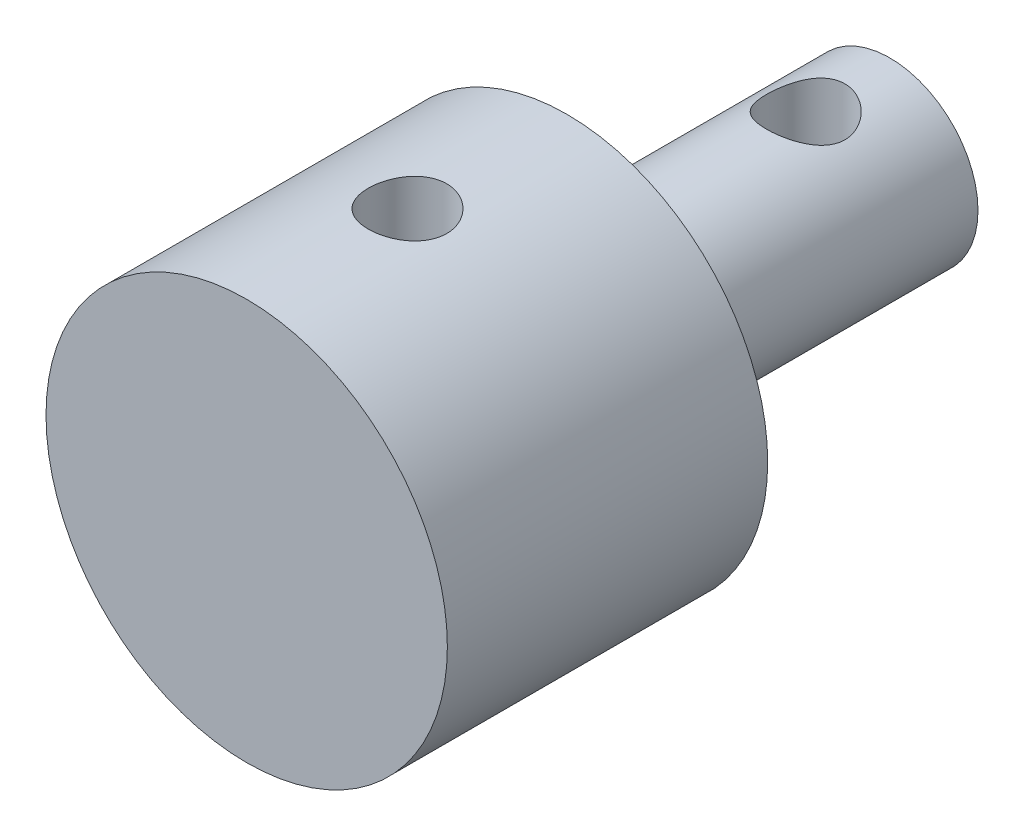
ISO-10303-21;
HEADER;
FILE_DESCRIPTION(('STEP AP214'),'2;1');
FILE_NAME('part.step','',(''),(''),'','','');
FILE_SCHEMA(('AUTOMOTIVE_DESIGN { 1 0 10303 214 1 1 1 1 }'));
ENDSEC;
DATA;
#1=APPLICATION_CONTEXT('core data for automotive mechanical design processes');
#2=APPLICATION_PROTOCOL_DEFINITION('international standard','automotive_design',2000,#1);
#3=PRODUCT_CONTEXT('',#1,'mechanical');
#4=PRODUCT('Part','Part','',(#3));
#5=PRODUCT_RELATED_PRODUCT_CATEGORY('part','',(#4));
#6=PRODUCT_DEFINITION_FORMATION('','',#4);
#7=PRODUCT_DEFINITION_CONTEXT('part definition',#1,'design');
#8=PRODUCT_DEFINITION('design','',#6,#7);
#9=PRODUCT_DEFINITION_SHAPE('','',#8);
#10=(LENGTH_UNIT() NAMED_UNIT(*) SI_UNIT(.MILLI.,.METRE.));
#11=(NAMED_UNIT(*) PLANE_ANGLE_UNIT() SI_UNIT($,.RADIAN.));
#12=(NAMED_UNIT(*) SI_UNIT($,.STERADIAN.) SOLID_ANGLE_UNIT());
#13=UNCERTAINTY_MEASURE_WITH_UNIT(LENGTH_MEASURE(1.E-05),#10,'distance_accuracy_value','');
#14=(GEOMETRIC_REPRESENTATION_CONTEXT(3) GLOBAL_UNCERTAINTY_ASSIGNED_CONTEXT((#13)) GLOBAL_UNIT_ASSIGNED_CONTEXT((#10,
#11,#12)) REPRESENTATION_CONTEXT('',''));
#15=CARTESIAN_POINT('',(0.,0.,0.));
#16=DIRECTION('',(0.,0.,1.));
#17=DIRECTION('',(1.,0.,0.));
#18=AXIS2_PLACEMENT_3D('',#15,#16,#17);
#19=CARTESIAN_POINT('',(0.,0.,25.4));
#20=DIRECTION('',(0.,0.,-1.));
#21=DIRECTION('',(-1.,0.,0.));
#22=AXIS2_PLACEMENT_3D('',#19,#20,#21);
#23=CYLINDRICAL_SURFACE('',#22,7.925);
#24=CARTESIAN_POINT('',(0.,-7.925,20.6));
#25=CARTESIAN_POINT('',(0.0861838108453866,-7.92499841926355,20.5999967837673));
#26=CARTESIAN_POINT('',(0.17240870233735,-7.92357967552833,20.5927876642372));
#27=CARTESIAN_POINT('',(0.342423948086106,-7.91805683622166,20.56416299903));
#28=CARTESIAN_POINT('',(0.426212267025402,-7.91395055939029,20.5427359135489));
#29=CARTESIAN_POINT('',(0.588871412790293,-7.90351147229811,20.4863603860152));
#30=CARTESIAN_POINT('',(0.667746772772678,-7.89718075144916,20.4514246295233));
#31=CARTESIAN_POINT('',(0.818510394217395,-7.88298210045821,20.3690605539179));
#32=CARTESIAN_POINT('',(0.890399124917666,-7.87511427365873,20.3216330745718));
#33=CARTESIAN_POINT('',(1.02608800119762,-7.85859405840611,20.2149789338671));
#34=CARTESIAN_POINT('',(1.08978438212797,-7.84993361146879,20.155621494742));
#35=CARTESIAN_POINT('',(1.20638226030049,-7.83286329328287,20.0270735742275));
#36=CARTESIAN_POINT('',(1.25928293936707,-7.82445344106734,19.957882348237));
#37=CARTESIAN_POINT('',(1.35322579664995,-7.80875795055944,19.8108892501759));
#38=CARTESIAN_POINT('',(1.39416121115848,-7.80148268877842,19.733017939903));
#39=CARTESIAN_POINT('',(1.46232775062974,-7.78899423853807,19.5713369959598));
#40=CARTESIAN_POINT('',(1.48956016704955,-7.78378085576415,19.4875279227514));
#41=CARTESIAN_POINT('',(1.52921220075574,-7.77608782468047,19.3174647091172));
#42=CARTESIAN_POINT('',(1.54181348339279,-7.77357467919549,19.2312544717756));
#43=CARTESIAN_POINT('',(1.55240967453143,-7.77146578630902,19.0579096084589));
#44=CARTESIAN_POINT('',(1.55040601008254,-7.77186975387635,18.9707750736277));
#45=CARTESIAN_POINT('',(1.53199621639429,-7.775518986543,18.7993794610282));
#46=CARTESIAN_POINT('',(1.51579773382123,-7.77872328560814,18.7150950778425));
#47=CARTESIAN_POINT('',(1.46978561127739,-7.7875476905229,18.5504637381507));
#48=CARTESIAN_POINT('',(1.43997134680109,-7.79316790718102,18.4701169624354));
#49=CARTESIAN_POINT('',(1.36737398097193,-7.80623311261551,18.3150398811511));
#50=CARTESIAN_POINT('',(1.32450802186827,-7.81368969988944,18.2403493819913));
#51=CARTESIAN_POINT('',(1.2270825854135,-7.82957995115312,18.099143482776));
#52=CARTESIAN_POINT('',(1.17252182062576,-7.83801372267035,18.0326289840547));
#53=CARTESIAN_POINT('',(1.0521409836078,-7.85508591343413,17.9084644535961));
#54=CARTESIAN_POINT('',(0.986143548277975,-7.86372535899091,17.8509863832633));
#55=CARTESIAN_POINT('',(0.845353664724789,-7.88010257327559,17.7478902773619));
#56=CARTESIAN_POINT('',(0.77056111296,-7.88784033138615,17.7022723814388));
#57=CARTESIAN_POINT('',(0.61411726395948,-7.90156009368255,17.6241620785197));
#58=CARTESIAN_POINT('',(0.532456233632123,-7.9075395504362,17.5916886899455));
#59=CARTESIAN_POINT('',(0.364695002697914,-7.91704953308192,17.5409691222318));
#60=CARTESIAN_POINT('',(0.278595317165379,-7.92058034243791,17.5227212962613));
#61=CARTESIAN_POINT('',(0.1058791754735,-7.92475592153562,17.5012128200005));
#62=CARTESIAN_POINT('',(0.0192930994156984,-7.92544602352876,17.4977167372747));
#63=CARTESIAN_POINT('',(-0.153226133355567,-7.92398809704793,17.5051778491985));
#64=CARTESIAN_POINT('',(-0.239159324850617,-7.9218402208451,17.516134268402));
#65=CARTESIAN_POINT('',(-0.407178536745109,-7.91497599311411,17.5519937207594));
#66=CARTESIAN_POINT('',(-0.489291194451464,-7.91028178748217,17.5767765552519));
#67=CARTESIAN_POINT('',(-0.648195694215873,-7.89884923165551,17.6394544563723));
#68=CARTESIAN_POINT('',(-0.724987150309032,-7.89211073337152,17.6773504729516));
#69=CARTESIAN_POINT('',(-0.872066606050378,-7.87722407193125,17.7656925623776));
#70=CARTESIAN_POINT('',(-0.942267392417723,-7.86906024608956,17.8162811408567));
#71=CARTESIAN_POINT('',(-1.07326791977358,-7.85226658751978,17.9283807930467));
#72=CARTESIAN_POINT('',(-1.13406669873031,-7.84363670722582,17.9898929831013));
#73=CARTESIAN_POINT('',(-1.24544096012996,-7.82673164163632,18.1231634257448));
#74=CARTESIAN_POINT('',(-1.29585515535405,-7.8184634273025,18.1950575013779));
#75=CARTESIAN_POINT('',(-1.38389200017043,-7.80336281640772,18.346431933197));
#76=CARTESIAN_POINT('',(-1.42151514932589,-7.79653036377608,18.4259119929519));
#77=CARTESIAN_POINT('',(-1.48267865261352,-7.78513059768089,18.5898101035222));
#78=CARTESIAN_POINT('',(-1.506290279852,-7.78055184089878,18.6742007230067));
#79=CARTESIAN_POINT('',(-1.53897802198646,-7.77415294549628,18.8458501668698));
#80=CARTESIAN_POINT('',(-1.54805593941779,-7.77233246478372,18.933108634195));
#81=CARTESIAN_POINT('',(-1.55135415156336,-7.77167464832441,19.1063988676115));
#82=CARTESIAN_POINT('',(-1.545829140864,-7.77278617379779,19.1924256938153));
#83=CARTESIAN_POINT('',(-1.52063882684956,-7.77775318086787,19.3622986215592));
#84=CARTESIAN_POINT('',(-1.5009736262888,-7.78160864252486,19.4461447389414));
#85=CARTESIAN_POINT('',(-1.4481725782255,-7.79160671898283,19.609123126546));
#86=CARTESIAN_POINT('',(-1.41506665015915,-7.79774425129309,19.6882654219184));
#87=CARTESIAN_POINT('',(-1.33635262416708,-7.81161806702618,19.839912430142));
#88=CARTESIAN_POINT('',(-1.29074353674063,-7.81935447697234,19.9124166170468));
#89=CARTESIAN_POINT('',(-1.18744235013671,-7.83571164154751,20.0500002623682));
#90=CARTESIAN_POINT('',(-1.12956579816527,-7.84434473268747,20.1149397871895));
#91=CARTESIAN_POINT('',(-1.00375480711516,-7.86143264989829,20.2342696728911));
#92=CARTESIAN_POINT('',(-0.935818060707144,-7.8698874345646,20.288657607111));
#93=CARTESIAN_POINT('',(-0.791005261002712,-7.88576493622371,20.3858485553922));
#94=CARTESIAN_POINT('',(-0.714047137150093,-7.8931765707638,20.4285311647171));
#95=CARTESIAN_POINT('',(-0.553928891907305,-7.90602394186755,20.5002913483058));
#96=CARTESIAN_POINT('',(-0.47077452700537,-7.91146148550279,20.5293813721837));
#97=CARTESIAN_POINT('',(-0.322843472408581,-7.91867276855423,20.5673981409176));
#98=CARTESIAN_POINT('',(-0.258917328106175,-7.92103177083739,20.5796023690083));
#99=CARTESIAN_POINT('',(-0.13000189383201,-7.92419595989978,20.5959043922953));
#100=CARTESIAN_POINT('',(-0.0650126352180937,-7.92500119242629,20.6000024261606));
#101=CARTESIAN_POINT('',(0.,-7.925,20.6));
#102=B_SPLINE_CURVE_WITH_KNOTS('',3,(#24,#25,#26,#27,#28,#29,#30,#31,#32,#33,#34,#35,#36,#37,
#38,#39,#40,#41,#42,#43,#44,#45,#46,#47,#48,#49,#50,#51,#52,#53,#54,#55,#56,#57,#58,#59,#60,#61,
#62,#63,#64,#65,#66,#67,#68,#69,#70,#71,#72,#73,#74,#75,#76,#77,#78,#79,#80,#81,#82,#83,#84,#85,
#86,#87,#88,#89,#90,#91,#92,#93,#94,#95,#96,#97,#98,#99,#100,#101),.UNSPECIFIED.,.T.,.F.,(4,2,2,
2,2,2,2,2,2,2,2,2,2,2,2,2,2,2,2,2,2,2,2,2,2,2,2,2,2,2,2,2,2,2,2,2,2,2,4),(0.,0.258313626033328,
0.516837165407023,0.77511852088897,1.03338251760152,1.29464935612841,1.55593598797964,
1.81948744358056,2.08301405577373,2.34323240377065,2.6034253261709,2.85987442698651,
3.11633529135459,3.37445948154057,3.6326121022432,3.8952006635526,4.15779231652299,
4.42076255952126,4.68370235508651,4.94242947154845,5.20114270662314,5.45764112156988,
5.71415812178877,5.97369523618958,6.2332588893888,6.49659198537846,6.75991479552951,
7.02188640414186,7.28382551935222,7.54122634017236,7.79862529052409,8.05545437803332,
8.31230379688142,8.57333059290651,8.83441734903393,9.09809677008675,9.36153420825261,
9.55639846233918,9.75125697899604),.UNSPECIFIED.);
#103=CARTESIAN_POINT('',(0.,-7.925,20.6));
#104=VERTEX_POINT('',#103);
#105=EDGE_CURVE('E11',#104,#104,#102,.T.);
#106=ORIENTED_EDGE('',*,*,#105,.T.);
#107=EDGE_LOOP('',(#106));
#108=FACE_BOUND('',#107,.T.);
#109=CARTESIAN_POINT('',(0.,7.925,20.6));
#110=CARTESIAN_POINT('',(-0.0861838108453866,7.92499841926355,20.5999967837673));
#111=CARTESIAN_POINT('',(-0.17240870233735,7.92357967552833,20.5927876642372));
#112=CARTESIAN_POINT('',(-0.342423948086106,7.91805683622166,20.56416299903));
#113=CARTESIAN_POINT('',(-0.426212267025402,7.91395055939029,20.5427359135489));
#114=CARTESIAN_POINT('',(-0.588871412790293,7.90351147229811,20.4863603860152));
#115=CARTESIAN_POINT('',(-0.667746772772678,7.89718075144916,20.4514246295233));
#116=CARTESIAN_POINT('',(-0.818510394217395,7.88298210045821,20.3690605539179));
#117=CARTESIAN_POINT('',(-0.890399124917666,7.87511427365873,20.3216330745718));
#118=CARTESIAN_POINT('',(-1.02608800119762,7.85859405840611,20.2149789338671));
#119=CARTESIAN_POINT('',(-1.08978438212797,7.84993361146879,20.155621494742));
#120=CARTESIAN_POINT('',(-1.20638226030049,7.83286329328287,20.0270735742275));
#121=CARTESIAN_POINT('',(-1.25928293936707,7.82445344106734,19.957882348237));
#122=CARTESIAN_POINT('',(-1.35322579664995,7.80875795055944,19.8108892501759));
#123=CARTESIAN_POINT('',(-1.39416121115848,7.80148268877842,19.733017939903));
#124=CARTESIAN_POINT('',(-1.46232775062974,7.78899423853807,19.5713369959598));
#125=CARTESIAN_POINT('',(-1.48956016704955,7.78378085576415,19.4875279227514));
#126=CARTESIAN_POINT('',(-1.52921220075574,7.77608782468047,19.3174647091172));
#127=CARTESIAN_POINT('',(-1.54181348339279,7.77357467919549,19.2312544717756));
#128=CARTESIAN_POINT('',(-1.55240967453143,7.77146578630902,19.0579096084589));
#129=CARTESIAN_POINT('',(-1.55040601008254,7.77186975387635,18.9707750736277));
#130=CARTESIAN_POINT('',(-1.53199621639429,7.775518986543,18.7993794610282));
#131=CARTESIAN_POINT('',(-1.51579773382123,7.77872328560814,18.7150950778425));
#132=CARTESIAN_POINT('',(-1.46978561127739,7.7875476905229,18.5504637381507));
#133=CARTESIAN_POINT('',(-1.43997134680109,7.79316790718102,18.4701169624354));
#134=CARTESIAN_POINT('',(-1.36737398097193,7.80623311261551,18.3150398811511));
#135=CARTESIAN_POINT('',(-1.32450802186827,7.81368969988944,18.2403493819913));
#136=CARTESIAN_POINT('',(-1.2270825854135,7.82957995115312,18.099143482776));
#137=CARTESIAN_POINT('',(-1.17252182062576,7.83801372267035,18.0326289840547));
#138=CARTESIAN_POINT('',(-1.0521409836078,7.85508591343413,17.9084644535961));
#139=CARTESIAN_POINT('',(-0.986143548277975,7.86372535899091,17.8509863832633));
#140=CARTESIAN_POINT('',(-0.845353664724789,7.88010257327559,17.7478902773619));
#141=CARTESIAN_POINT('',(-0.77056111296,7.88784033138615,17.7022723814388));
#142=CARTESIAN_POINT('',(-0.61411726395948,7.90156009368255,17.6241620785197));
#143=CARTESIAN_POINT('',(-0.532456233632123,7.9075395504362,17.5916886899455));
#144=CARTESIAN_POINT('',(-0.364695002697914,7.91704953308192,17.5409691222318));
#145=CARTESIAN_POINT('',(-0.278595317165379,7.92058034243791,17.5227212962613));
#146=CARTESIAN_POINT('',(-0.1058791754735,7.92475592153562,17.5012128200005));
#147=CARTESIAN_POINT('',(-0.0192930994156984,7.92544602352876,17.4977167372747));
#148=CARTESIAN_POINT('',(0.153226133355567,7.92398809704793,17.5051778491985));
#149=CARTESIAN_POINT('',(0.239159324850617,7.9218402208451,17.516134268402));
#150=CARTESIAN_POINT('',(0.407178536745109,7.91497599311411,17.5519937207594));
#151=CARTESIAN_POINT('',(0.489291194451464,7.91028178748217,17.5767765552519));
#152=CARTESIAN_POINT('',(0.648195694215873,7.89884923165551,17.6394544563723));
#153=CARTESIAN_POINT('',(0.724987150309032,7.89211073337152,17.6773504729516));
#154=CARTESIAN_POINT('',(0.872066606050378,7.87722407193125,17.7656925623776));
#155=CARTESIAN_POINT('',(0.942267392417723,7.86906024608956,17.8162811408567));
#156=CARTESIAN_POINT('',(1.07326791977358,7.85226658751978,17.9283807930467));
#157=CARTESIAN_POINT('',(1.13406669873031,7.84363670722582,17.9898929831013));
#158=CARTESIAN_POINT('',(1.24544096012996,7.82673164163632,18.1231634257448));
#159=CARTESIAN_POINT('',(1.29585515535405,7.8184634273025,18.1950575013779));
#160=CARTESIAN_POINT('',(1.38389200017043,7.80336281640772,18.346431933197));
#161=CARTESIAN_POINT('',(1.42151514932589,7.79653036377608,18.4259119929519));
#162=CARTESIAN_POINT('',(1.48267865261352,7.78513059768089,18.5898101035222));
#163=CARTESIAN_POINT('',(1.506290279852,7.78055184089878,18.6742007230067));
#164=CARTESIAN_POINT('',(1.53897802198646,7.77415294549628,18.8458501668698));
#165=CARTESIAN_POINT('',(1.54805593941779,7.77233246478372,18.933108634195));
#166=CARTESIAN_POINT('',(1.55135415156336,7.77167464832441,19.1063988676115));
#167=CARTESIAN_POINT('',(1.545829140864,7.77278617379779,19.1924256938153));
#168=CARTESIAN_POINT('',(1.52063882684956,7.77775318086787,19.3622986215592));
#169=CARTESIAN_POINT('',(1.5009736262888,7.78160864252486,19.4461447389414));
#170=CARTESIAN_POINT('',(1.4481725782255,7.79160671898283,19.609123126546));
#171=CARTESIAN_POINT('',(1.41506665015915,7.79774425129309,19.6882654219184));
#172=CARTESIAN_POINT('',(1.33635262416708,7.81161806702618,19.839912430142));
#173=CARTESIAN_POINT('',(1.29074353674063,7.81935447697234,19.9124166170468));
#174=CARTESIAN_POINT('',(1.18744235013671,7.83571164154751,20.0500002623682));
#175=CARTESIAN_POINT('',(1.12956579816527,7.84434473268747,20.1149397871895));
#176=CARTESIAN_POINT('',(1.00375480711516,7.86143264989829,20.2342696728911));
#177=CARTESIAN_POINT('',(0.935818060707144,7.8698874345646,20.288657607111));
#178=CARTESIAN_POINT('',(0.791005261002712,7.88576493622371,20.3858485553922));
#179=CARTESIAN_POINT('',(0.714047137150093,7.8931765707638,20.4285311647171));
#180=CARTESIAN_POINT('',(0.553928891907305,7.90602394186755,20.5002913483058));
#181=CARTESIAN_POINT('',(0.47077452700537,7.91146148550279,20.5293813721837));
#182=CARTESIAN_POINT('',(0.322843472408581,7.91867276855423,20.5673981409176));
#183=CARTESIAN_POINT('',(0.258917328106175,7.92103177083739,20.5796023690083));
#184=CARTESIAN_POINT('',(0.13000189383201,7.92419595989978,20.5959043922953));
#185=CARTESIAN_POINT('',(0.0650126352180937,7.92500119242629,20.6000024261606));
#186=CARTESIAN_POINT('',(0.,7.925,20.6));
#187=B_SPLINE_CURVE_WITH_KNOTS('',3,(#109,#110,#111,#112,#113,#114,#115,#116,#117,#118,#119,
#120,#121,#122,#123,#124,#125,#126,#127,#128,#129,#130,#131,#132,#133,#134,#135,#136,#137,#138,
#139,#140,#141,#142,#143,#144,#145,#146,#147,#148,#149,#150,#151,#152,#153,#154,#155,#156,#157,
#158,#159,#160,#161,#162,#163,#164,#165,#166,#167,#168,#169,#170,#171,#172,#173,#174,#175,#176,
#177,#178,#179,#180,#181,#182,#183,#184,#185,#186),.UNSPECIFIED.,.T.,.F.,(4,2,2,2,2,2,2,2,2,2,2,
2,2,2,2,2,2,2,2,2,2,2,2,2,2,2,2,2,2,2,2,2,2,2,2,2,2,2,4),(0.,0.258313626033328,
0.516837165407023,0.77511852088897,1.03338251760152,1.29464935612841,1.55593598797964,
1.81948744358056,2.08301405577373,2.34323240377065,2.6034253261709,2.85987442698651,
3.11633529135459,3.37445948154057,3.6326121022432,3.8952006635526,4.15779231652299,
4.42076255952126,4.68370235508651,4.94242947154845,5.20114270662314,5.45764112156988,
5.71415812178877,5.97369523618958,6.2332588893888,6.49659198537846,6.75991479552951,
7.02188640414186,7.28382551935222,7.54122634017236,7.79862529052409,8.05545437803332,
8.31230379688142,8.57333059290651,8.83441734903393,9.09809677008675,9.36153420825261,
9.55639846233918,9.75125697899604),.UNSPECIFIED.);
#188=CARTESIAN_POINT('',(0.,7.925,20.6));
#189=VERTEX_POINT('',#188);
#190=EDGE_CURVE('E71',#189,#189,#187,.T.);
#191=ORIENTED_EDGE('',*,*,#190,.T.);
#192=EDGE_LOOP('',(#191));
#193=FACE_BOUND('',#192,.T.);
#194=CARTESIAN_POINT('',(0.,0.,12.75));
#195=DIRECTION('',(0.,0.,1.));
#196=DIRECTION('',(1.,0.,0.));
#197=AXIS2_PLACEMENT_3D('',#194,#195,#196);
#198=CIRCLE('',#197,7.925);
#199=CARTESIAN_POINT('',(7.925,0.,12.75));
#200=VERTEX_POINT('',#199);
#201=EDGE_CURVE('E79',#200,#200,#198,.T.);
#202=ORIENTED_EDGE('',*,*,#201,.T.);
#203=EDGE_LOOP('',(#202));
#204=FACE_BOUND('',#203,.T.);
#205=CARTESIAN_POINT('',(0.,0.,25.4));
#206=DIRECTION('',(0.,0.,1.));
#207=DIRECTION('',(1.,0.,0.));
#208=AXIS2_PLACEMENT_3D('',#205,#206,#207);
#209=CIRCLE('',#208,7.925);
#210=CARTESIAN_POINT('',(7.925,0.,25.4));
#211=VERTEX_POINT('',#210);
#212=EDGE_CURVE('E75',#211,#211,#209,.T.);
#213=ORIENTED_EDGE('',*,*,#212,.F.);
#214=EDGE_LOOP('',(#213));
#215=FACE_BOUND('',#214,.T.);
#216=ADVANCED_FACE('F61',(#108,#193,#204,#215),#23,.T.);
#217=CARTESIAN_POINT('',(0.,0.,25.4));
#218=DIRECTION('',(0.,0.,1.));
#219=DIRECTION('',(1.,0.,0.));
#220=AXIS2_PLACEMENT_3D('',#217,#218,#219);
#221=PLANE('',#220);
#222=ORIENTED_EDGE('',*,*,#212,.T.);
#223=EDGE_LOOP('',(#222));
#224=FACE_BOUND('',#223,.T.);
#225=ADVANCED_FACE('F131',(#224),#221,.T.);
#226=CARTESIAN_POINT('',(0.,0.,12.75));
#227=DIRECTION('',(0.,0.,1.));
#228=DIRECTION('',(1.,0.,0.));
#229=AXIS2_PLACEMENT_3D('',#226,#227,#228);
#230=PLANE('',#229);
#231=CARTESIAN_POINT('',(0.,0.,12.75));
#232=DIRECTION('',(0.,0.,1.));
#233=DIRECTION('',(1.,0.,0.));
#234=AXIS2_PLACEMENT_3D('',#231,#232,#233);
#235=CIRCLE('',#234,3.48);
#236=CARTESIAN_POINT('',(3.48,0.,12.75));
#237=VERTEX_POINT('',#236);
#238=EDGE_CURVE('E110',#237,#237,#235,.T.);
#239=ORIENTED_EDGE('',*,*,#238,.T.);
#240=EDGE_LOOP('',(#239));
#241=FACE_BOUND('',#240,.T.);
#242=ORIENTED_EDGE('',*,*,#201,.F.);
#243=EDGE_LOOP('',(#242));
#244=FACE_BOUND('',#243,.T.);
#245=ADVANCED_FACE('F124',(#241,#244),#230,.F.);
#246=CARTESIAN_POINT('',(0.,0.,12.75));
#247=DIRECTION('',(0.,0.,-1.));
#248=DIRECTION('',(-1.,0.,0.));
#249=AXIS2_PLACEMENT_3D('',#246,#247,#248);
#250=CYLINDRICAL_SURFACE('',#249,3.48);
#251=CARTESIAN_POINT('',(0.,-3.48,4.875));
#252=CARTESIAN_POINT('',(0.0825138042025776,-3.47999681166933,4.87499610911732));
#253=CARTESIAN_POINT('',(0.165156099422567,-3.47703251674291,4.86837230389632));
#254=CARTESIAN_POINT('',(0.328062088482595,-3.46546962291386,4.84214006073431));
#255=CARTESIAN_POINT('',(0.408319602955723,-3.45685752948132,4.82250052254695));
#256=CARTESIAN_POINT('',(0.563841877376707,-3.4349130798989,4.77112006367128));
#257=CARTESIAN_POINT('',(0.639123364704403,-3.42159760494223,4.7394223906597));
#258=CARTESIAN_POINT('',(0.78321678617367,-3.39151831157571,4.66501920292595));
#259=CARTESIAN_POINT('',(0.852030173435168,-3.37475527040513,4.62231616876779));
#260=CARTESIAN_POINT('',(0.985187182241665,-3.33838440203311,4.52461178753005));
#261=CARTESIAN_POINT('',(1.04912428848442,-3.31867513356709,4.46909459197347));
#262=CARTESIAN_POINT('',(1.16713893116451,-3.27903487448125,4.34843334274395));
#263=CARTESIAN_POINT('',(1.22121056511317,-3.25910375864677,4.28328356784173));
#264=CARTESIAN_POINT('',(1.32107746140071,-3.21996879648826,4.14063730446805));
#265=CARTESIAN_POINT('',(1.36621009388527,-3.20087432701701,4.06264363911592));
#266=CARTESIAN_POINT('',(1.44253512626648,-3.16721410459599,3.89920631486317));
#267=CARTESIAN_POINT('',(1.47373569733,-3.15264569863538,3.81376705804748));
#268=CARTESIAN_POINT('',(1.51957343560433,-3.13080092448009,3.6425355259664));
#269=CARTESIAN_POINT('',(1.53499762232161,-3.12318038784488,3.55699969542774));
#270=CARTESIAN_POINT('',(1.55129121683332,-3.11512236121552,3.38424112670931));
#271=CARTESIAN_POINT('',(1.5521704098892,-3.11468004202168,3.29701956217336));
#272=CARTESIAN_POINT('',(1.53993585497871,-3.12074149270909,3.13176157445786));
#273=CARTESIAN_POINT('',(1.52807398392069,-3.12662387917202,3.05360481079073));
#274=CARTESIAN_POINT('',(1.49281647558756,-3.14360903889719,2.90053540964712));
#275=CARTESIAN_POINT('',(1.4694182316481,-3.15471299195563,2.82562350951687));
#276=CARTESIAN_POINT('',(1.41128859223433,-3.18114751632626,2.67915535912476));
#277=CARTESIAN_POINT('',(1.37631425614932,-3.19656748906207,2.60771239780291));
#278=CARTESIAN_POINT('',(1.29620009871018,-3.22988308808876,2.4714066303134));
#279=CARTESIAN_POINT('',(1.25105598925041,-3.2477797574525,2.4065466166417));
#280=CARTESIAN_POINT('',(1.14670786053793,-3.28615889477307,2.27856471324293));
#281=CARTESIAN_POINT('',(1.08656015679323,-3.30672300115649,2.21623435150887));
#282=CARTESIAN_POINT('',(0.956494403407271,-3.34666170618366,2.10225796782148));
#283=CARTESIAN_POINT('',(0.886573385682492,-3.3660359408897,2.0506152034758));
#284=CARTESIAN_POINT('',(0.736246383006499,-3.40212929046977,1.95808542789697));
#285=CARTESIAN_POINT('',(0.655590138080516,-3.41875213759735,1.91756458137013));
#286=CARTESIAN_POINT('',(0.487675125128289,-3.44670812113681,1.85095237096535));
#287=CARTESIAN_POINT('',(0.400420577556669,-3.45804460614251,1.82485187071969));
#288=CARTESIAN_POINT('',(0.228361096839682,-3.47349724876202,1.7895799630011));
#289=CARTESIAN_POINT('',(0.143813950176328,-3.47806426626032,1.77934908850201));
#290=CARTESIAN_POINT('',(-0.0259074587282179,-3.48093695987979,1.77289397081828));
#291=CARTESIAN_POINT('',(-0.111081496804079,-3.47924477504396,1.77666494259248));
#292=CARTESIAN_POINT('',(-0.274383097297363,-3.47007459716374,1.79738955956249));
#293=CARTESIAN_POINT('',(-0.352631660315413,-3.46294031281551,1.81356037031946));
#294=CARTESIAN_POINT('',(-0.505196154868794,-3.44399326446443,1.85749158713686));
#295=CARTESIAN_POINT('',(-0.579511607959235,-3.43217993275292,1.88525339955529));
#296=CARTESIAN_POINT('',(-0.72473357501279,-3.40452613963596,1.95246092923999));
#297=CARTESIAN_POINT('',(-0.795461496049095,-3.38857157536076,1.99224402676711));
#298=CARTESIAN_POINT('',(-0.929492623388258,-3.35428637158146,2.08199719352983));
#299=CARTESIAN_POINT('',(-0.992792574366815,-3.33595469765736,2.13197170310095));
#300=CARTESIAN_POINT('',(-1.11557116119041,-3.29702559079623,2.24539889226725));
#301=CARTESIAN_POINT('',(-1.17432623926439,-3.27636484161449,2.30961493092323));
#302=CARTESIAN_POINT('',(-1.28047075664014,-3.23635899115961,2.44724701001793));
#303=CARTESIAN_POINT('',(-1.32785611063257,-3.21701436457207,2.52066634295301));
#304=CARTESIAN_POINT('',(-1.41088156317506,-3.18149463774805,2.67698382876157));
#305=CARTESIAN_POINT('',(-1.44621467780289,-3.16540610682785,2.7600662486867));
#306=CARTESIAN_POINT('',(-1.50205127286023,-3.13930069440551,2.93195258323646));
#307=CARTESIAN_POINT('',(-1.52256934866136,-3.12927783874609,3.02075077262342));
#308=CARTESIAN_POINT('',(-1.54665092235713,-3.11744037916248,3.193420983328));
#309=CARTESIAN_POINT('',(-1.55150744975699,-3.11500042450126,3.27707006120199));
#310=CARTESIAN_POINT('',(-1.54767847902321,-3.11690510897541,3.44396922896562));
#311=CARTESIAN_POINT('',(-1.53899590231256,-3.12124828446977,3.52721940104205));
#312=CARTESIAN_POINT('',(-1.50946877168784,-3.13562519196414,3.68570814287313));
#313=CARTESIAN_POINT('',(-1.48939411469089,-3.14529765815639,3.76112633408359));
#314=CARTESIAN_POINT('',(-1.4384672838826,-3.16891073478087,3.90751375594226));
#315=CARTESIAN_POINT('',(-1.40761199087367,-3.18285258034257,3.97848169196633));
#316=CARTESIAN_POINT('',(-1.33373451978635,-3.21453945487674,4.11894494424264));
#317=CARTESIAN_POINT('',(-1.29005845490881,-3.23247117199846,4.18805328214754));
#318=CARTESIAN_POINT('',(-1.19262644131027,-3.26967275938268,4.31836146419108));
#319=CARTESIAN_POINT('',(-1.13886625937205,-3.28894318947734,4.37955796872511));
#320=CARTESIAN_POINT('',(-1.01719926215011,-3.32868550248897,4.49786927303516));
#321=CARTESIAN_POINT('',(-0.948463816899035,-3.34911386196395,4.55415083411738));
#322=CARTESIAN_POINT('',(-0.801809482597493,-3.38721624980243,4.65447054724104));
#323=CARTESIAN_POINT('',(-0.723886417175416,-3.40488901702686,4.69850310052237));
#324=CARTESIAN_POINT('',(-0.561740736811779,-3.43534224130427,4.77234141091125));
#325=CARTESIAN_POINT('',(-0.477597525720771,-3.44817475712333,4.80229945877247));
#326=CARTESIAN_POINT('',(-0.304886034686776,-3.46769971865061,4.84732046801229));
#327=CARTESIAN_POINT('',(-0.216332114796511,-3.47441087141069,4.86242882151508));
#328=CARTESIAN_POINT('',(-0.106030948221991,-3.47844965815526,4.87151586876863));
#329=CARTESIAN_POINT('',(-0.0848524431676311,-3.47903003123586,4.87282119074979));
#330=CARTESIAN_POINT('',(-0.0424521277988696,-3.47980561463249,4.87456376211083));
#331=CARTESIAN_POINT('',(-0.0212303169692158,-3.48000082033875,4.87500100110125));
#332=CARTESIAN_POINT('',(0.,-3.48,4.875));
#333=B_SPLINE_CURVE_WITH_KNOTS('',3,(#251,#252,#253,#254,#255,#256,#257,#258,#259,#260,#261,
#262,#263,#264,#265,#266,#267,#268,#269,#270,#271,#272,#273,#274,#275,#276,#277,#278,#279,#280,
#281,#282,#283,#284,#285,#286,#287,#288,#289,#290,#291,#292,#293,#294,#295,#296,#297,#298,#299,
#300,#301,#302,#303,#304,#305,#306,#307,#308,#309,#310,#311,#312,#313,#314,#315,#316,#317,#318,
#319,#320,#321,#322,#323,#324,#325,#326,#327,#328,#329,#330,#331,#332),.UNSPECIFIED.,.T.,.F.,(4,
2,2,2,2,2,2,2,2,2,2,2,2,2,2,2,2,2,2,2,2,2,2,2,2,2,2,2,2,2,2,2,2,2,2,2,2,2,2,2,4),(0.,
0.247454163081916,0.495501743916435,0.742667939984389,0.989778474438045,1.2494824733481,
1.5093413466349,1.78428459462804,2.05906637566837,2.31935098511678,2.57946047887499,
2.8161670054581,3.05292704083745,3.29500934223995,3.53719390983087,3.80308366100026,
4.06905433708567,4.34294675586586,4.61666544373422,4.87117590919501,5.12559940534302,
5.36516260489037,5.6047548795414,5.85181922850535,6.09899145275122,6.36616214591607,
6.63342869416791,6.90706775050064,7.18043685591538,7.43056687767764,7.68064293468158,
7.91554554310987,8.15051617305729,8.40057040507981,8.65072984338912,8.92290571980176,
9.19520579835047,9.46448748568373,9.73294345642218,9.79661119655142,9.86027969866875),.UNSPECIFIED.);
#334=CARTESIAN_POINT('',(0.,-3.48,4.875));
#335=VERTEX_POINT('',#334);
#336=EDGE_CURVE('E84',#335,#335,#333,.T.);
#337=ORIENTED_EDGE('',*,*,#336,.T.);
#338=EDGE_LOOP('',(#337));
#339=FACE_BOUND('',#338,.T.);
#340=CARTESIAN_POINT('',(0.,3.48,4.875));
#341=CARTESIAN_POINT('',(-0.0825138042025776,3.47999681166933,4.87499610911732));
#342=CARTESIAN_POINT('',(-0.165156099422567,3.47703251674291,4.86837230389632));
#343=CARTESIAN_POINT('',(-0.328062088482595,3.46546962291386,4.84214006073431));
#344=CARTESIAN_POINT('',(-0.408319602955723,3.45685752948132,4.82250052254695));
#345=CARTESIAN_POINT('',(-0.563841877376707,3.4349130798989,4.77112006367128));
#346=CARTESIAN_POINT('',(-0.639123364704403,3.42159760494223,4.7394223906597));
#347=CARTESIAN_POINT('',(-0.78321678617367,3.39151831157571,4.66501920292595));
#348=CARTESIAN_POINT('',(-0.852030173435168,3.37475527040513,4.62231616876779));
#349=CARTESIAN_POINT('',(-0.985187182241665,3.33838440203311,4.52461178753005));
#350=CARTESIAN_POINT('',(-1.04912428848442,3.31867513356709,4.46909459197347));
#351=CARTESIAN_POINT('',(-1.16713893116451,3.27903487448125,4.34843334274395));
#352=CARTESIAN_POINT('',(-1.22121056511317,3.25910375864677,4.28328356784173));
#353=CARTESIAN_POINT('',(-1.32107746140071,3.21996879648826,4.14063730446805));
#354=CARTESIAN_POINT('',(-1.36621009388527,3.20087432701701,4.06264363911592));
#355=CARTESIAN_POINT('',(-1.44253512626648,3.16721410459599,3.89920631486317));
#356=CARTESIAN_POINT('',(-1.47373569733,3.15264569863538,3.81376705804748));
#357=CARTESIAN_POINT('',(-1.51957343560433,3.13080092448009,3.6425355259664));
#358=CARTESIAN_POINT('',(-1.53499762232161,3.12318038784488,3.55699969542774));
#359=CARTESIAN_POINT('',(-1.55129121683332,3.11512236121552,3.38424112670931));
#360=CARTESIAN_POINT('',(-1.5521704098892,3.11468004202168,3.29701956217336));
#361=CARTESIAN_POINT('',(-1.53993585497871,3.12074149270909,3.13176157445786));
#362=CARTESIAN_POINT('',(-1.52807398392069,3.12662387917202,3.05360481079073));
#363=CARTESIAN_POINT('',(-1.49281647558756,3.14360903889719,2.90053540964712));
#364=CARTESIAN_POINT('',(-1.4694182316481,3.15471299195563,2.82562350951687));
#365=CARTESIAN_POINT('',(-1.41128859223433,3.18114751632626,2.67915535912476));
#366=CARTESIAN_POINT('',(-1.37631425614932,3.19656748906207,2.60771239780291));
#367=CARTESIAN_POINT('',(-1.29620009871018,3.22988308808876,2.4714066303134));
#368=CARTESIAN_POINT('',(-1.25105598925041,3.2477797574525,2.4065466166417));
#369=CARTESIAN_POINT('',(-1.14670786053793,3.28615889477307,2.27856471324293));
#370=CARTESIAN_POINT('',(-1.08656015679323,3.30672300115649,2.21623435150887));
#371=CARTESIAN_POINT('',(-0.956494403407271,3.34666170618366,2.10225796782148));
#372=CARTESIAN_POINT('',(-0.886573385682492,3.3660359408897,2.0506152034758));
#373=CARTESIAN_POINT('',(-0.736246383006499,3.40212929046977,1.95808542789697));
#374=CARTESIAN_POINT('',(-0.655590138080516,3.41875213759735,1.91756458137013));
#375=CARTESIAN_POINT('',(-0.487675125128289,3.44670812113681,1.85095237096535));
#376=CARTESIAN_POINT('',(-0.400420577556669,3.45804460614251,1.82485187071969));
#377=CARTESIAN_POINT('',(-0.228361096839682,3.47349724876202,1.7895799630011));
#378=CARTESIAN_POINT('',(-0.143813950176328,3.47806426626032,1.77934908850201));
#379=CARTESIAN_POINT('',(0.0259074587282179,3.48093695987979,1.77289397081828));
#380=CARTESIAN_POINT('',(0.111081496804079,3.47924477504396,1.77666494259248));
#381=CARTESIAN_POINT('',(0.274383097297363,3.47007459716374,1.79738955956249));
#382=CARTESIAN_POINT('',(0.352631660315413,3.46294031281551,1.81356037031946));
#383=CARTESIAN_POINT('',(0.505196154868794,3.44399326446443,1.85749158713686));
#384=CARTESIAN_POINT('',(0.579511607959235,3.43217993275292,1.88525339955529));
#385=CARTESIAN_POINT('',(0.72473357501279,3.40452613963596,1.95246092923999));
#386=CARTESIAN_POINT('',(0.795461496049095,3.38857157536076,1.99224402676711));
#387=CARTESIAN_POINT('',(0.929492623388258,3.35428637158146,2.08199719352983));
#388=CARTESIAN_POINT('',(0.992792574366815,3.33595469765736,2.13197170310095));
#389=CARTESIAN_POINT('',(1.11557116119041,3.29702559079623,2.24539889226725));
#390=CARTESIAN_POINT('',(1.17432623926439,3.27636484161449,2.30961493092323));
#391=CARTESIAN_POINT('',(1.28047075664014,3.23635899115961,2.44724701001793));
#392=CARTESIAN_POINT('',(1.32785611063257,3.21701436457207,2.52066634295301));
#393=CARTESIAN_POINT('',(1.41088156317506,3.18149463774805,2.67698382876157));
#394=CARTESIAN_POINT('',(1.44621467780289,3.16540610682785,2.7600662486867));
#395=CARTESIAN_POINT('',(1.50205127286023,3.13930069440551,2.93195258323646));
#396=CARTESIAN_POINT('',(1.52256934866136,3.12927783874609,3.02075077262342));
#397=CARTESIAN_POINT('',(1.54665092235713,3.11744037916248,3.193420983328));
#398=CARTESIAN_POINT('',(1.55150744975699,3.11500042450126,3.27707006120199));
#399=CARTESIAN_POINT('',(1.54767847902321,3.11690510897541,3.44396922896562));
#400=CARTESIAN_POINT('',(1.53899590231256,3.12124828446977,3.52721940104205));
#401=CARTESIAN_POINT('',(1.50946877168784,3.13562519196414,3.68570814287313));
#402=CARTESIAN_POINT('',(1.48939411469089,3.14529765815639,3.76112633408359));
#403=CARTESIAN_POINT('',(1.4384672838826,3.16891073478087,3.90751375594226));
#404=CARTESIAN_POINT('',(1.40761199087367,3.18285258034257,3.97848169196633));
#405=CARTESIAN_POINT('',(1.33373451978635,3.21453945487674,4.11894494424264));
#406=CARTESIAN_POINT('',(1.29005845490881,3.23247117199846,4.18805328214754));
#407=CARTESIAN_POINT('',(1.19262644131027,3.26967275938268,4.31836146419108));
#408=CARTESIAN_POINT('',(1.13886625937205,3.28894318947734,4.37955796872511));
#409=CARTESIAN_POINT('',(1.01719926215011,3.32868550248897,4.49786927303516));
#410=CARTESIAN_POINT('',(0.948463816899035,3.34911386196395,4.55415083411738));
#411=CARTESIAN_POINT('',(0.801809482597493,3.38721624980243,4.65447054724104));
#412=CARTESIAN_POINT('',(0.723886417175416,3.40488901702686,4.69850310052237));
#413=CARTESIAN_POINT('',(0.561740736811779,3.43534224130427,4.77234141091125));
#414=CARTESIAN_POINT('',(0.477597525720771,3.44817475712333,4.80229945877247));
#415=CARTESIAN_POINT('',(0.304886034686776,3.46769971865061,4.84732046801229));
#416=CARTESIAN_POINT('',(0.216332114796511,3.47441087141069,4.86242882151508));
#417=CARTESIAN_POINT('',(0.106030948221991,3.47844965815526,4.87151586876863));
#418=CARTESIAN_POINT('',(0.0848524431676311,3.47903003123586,4.87282119074979));
#419=CARTESIAN_POINT('',(0.0424521277988696,3.47980561463249,4.87456376211083));
#420=CARTESIAN_POINT('',(0.0212303169692158,3.48000082033875,4.87500100110125));
#421=CARTESIAN_POINT('',(0.,3.48,4.875));
#422=B_SPLINE_CURVE_WITH_KNOTS('',3,(#340,#341,#342,#343,#344,#345,#346,#347,#348,#349,#350,
#351,#352,#353,#354,#355,#356,#357,#358,#359,#360,#361,#362,#363,#364,#365,#366,#367,#368,#369,
#370,#371,#372,#373,#374,#375,#376,#377,#378,#379,#380,#381,#382,#383,#384,#385,#386,#387,#388,
#389,#390,#391,#392,#393,#394,#395,#396,#397,#398,#399,#400,#401,#402,#403,#404,#405,#406,#407,
#408,#409,#410,#411,#412,#413,#414,#415,#416,#417,#418,#419,#420,#421),.UNSPECIFIED.,.T.,.F.,(4,
2,2,2,2,2,2,2,2,2,2,2,2,2,2,2,2,2,2,2,2,2,2,2,2,2,2,2,2,2,2,2,2,2,2,2,2,2,2,2,4),(0.,
0.247454163081916,0.495501743916435,0.742667939984389,0.989778474438045,1.2494824733481,
1.5093413466349,1.78428459462804,2.05906637566837,2.31935098511678,2.57946047887499,
2.8161670054581,3.05292704083745,3.29500934223995,3.53719390983087,3.80308366100026,
4.06905433708567,4.34294675586586,4.61666544373422,4.87117590919501,5.12559940534302,
5.36516260489037,5.6047548795414,5.85181922850535,6.09899145275122,6.36616214591607,
6.63342869416791,6.90706775050064,7.18043685591538,7.43056687767764,7.68064293468158,
7.91554554310987,8.15051617305729,8.40057040507981,8.65072984338912,8.92290571980176,
9.19520579835047,9.46448748568373,9.73294345642218,9.79661119655142,9.86027969866875),.UNSPECIFIED.);
#423=CARTESIAN_POINT('',(0.,3.48,4.875));
#424=VERTEX_POINT('',#423);
#425=EDGE_CURVE('E104',#424,#424,#422,.T.);
#426=ORIENTED_EDGE('',*,*,#425,.T.);
#427=EDGE_LOOP('',(#426));
#428=FACE_BOUND('',#427,.T.);
#429=ORIENTED_EDGE('',*,*,#238,.F.);
#430=EDGE_LOOP('',(#429));
#431=FACE_BOUND('',#430,.T.);
#432=CARTESIAN_POINT('',(0.,0.,0.));
#433=DIRECTION('',(0.,0.,1.));
#434=DIRECTION('',(1.,0.,0.));
#435=AXIS2_PLACEMENT_3D('',#432,#433,#434);
#436=CIRCLE('',#435,3.48);
#437=CARTESIAN_POINT('',(3.48,0.,0.));
#438=VERTEX_POINT('',#437);
#439=EDGE_CURVE('E114',#438,#438,#436,.T.);
#440=ORIENTED_EDGE('',*,*,#439,.T.);
#441=EDGE_LOOP('',(#440));
#442=FACE_BOUND('',#441,.T.);
#443=ADVANCED_FACE('F100',(#339,#428,#431,#442),#250,.T.);
#444=CARTESIAN_POINT('',(0.,0.,0.));
#445=DIRECTION('',(0.,0.,1.));
#446=DIRECTION('',(1.,0.,0.));
#447=AXIS2_PLACEMENT_3D('',#444,#445,#446);
#448=PLANE('',#447);
#449=ORIENTED_EDGE('',*,*,#439,.F.);
#450=EDGE_LOOP('',(#449));
#451=FACE_BOUND('',#450,.T.);
#452=ADVANCED_FACE('F98',(#451),#448,.F.);
#453=CARTESIAN_POINT('',(0.,-7.925,3.325));
#454=DIRECTION('',(0.,1.,0.));
#455=DIRECTION('',(0.,0.,1.));
#456=AXIS2_PLACEMENT_3D('',#453,#454,#455);
#457=CYLINDRICAL_SURFACE('',#456,1.55);
#458=ORIENTED_EDGE('',*,*,#425,.F.);
#459=EDGE_LOOP('',(#458));
#460=FACE_BOUND('',#459,.T.);
#461=ORIENTED_EDGE('',*,*,#336,.F.);
#462=EDGE_LOOP('',(#461));
#463=FACE_BOUND('',#462,.T.);
#464=ADVANCED_FACE('F93',(#460,#463),#457,.F.);
#465=CARTESIAN_POINT('',(0.,-7.925,19.05));
#466=DIRECTION('',(0.,1.,0.));
#467=DIRECTION('',(0.,0.,1.));
#468=AXIS2_PLACEMENT_3D('',#465,#466,#467);
#469=CYLINDRICAL_SURFACE('',#468,1.55);
#470=ORIENTED_EDGE('',*,*,#190,.F.);
#471=EDGE_LOOP('',(#470));
#472=FACE_BOUND('',#471,.T.);
#473=ORIENTED_EDGE('',*,*,#105,.F.);
#474=EDGE_LOOP('',(#473));
#475=FACE_BOUND('',#474,.T.);
#476=ADVANCED_FACE('F90',(#472,#475),#469,.F.);
#477=CLOSED_SHELL('',(#216,#225,#245,#443,#452,#464,#476));
#478=MANIFOLD_SOLID_BREP('B2',#477);
#479=ADVANCED_BREP_SHAPE_REPRESENTATION('',(#18,#478),#14);
#480=SHAPE_DEFINITION_REPRESENTATION(#9,#479);
ENDSEC;
END-ISO-10303-21;
